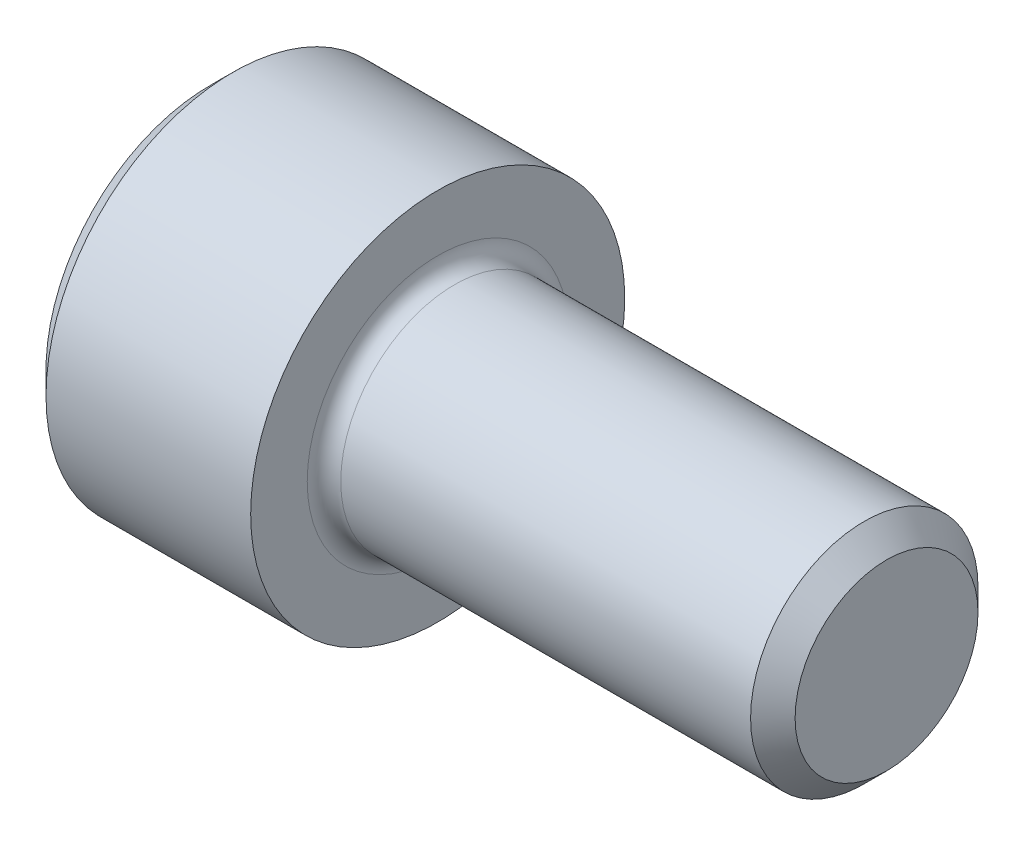
ISO-10303-21;
HEADER;
FILE_DESCRIPTION(('STEP AP214'),'2;1');
FILE_NAME('part.step','',(''),(''),'','','');
FILE_SCHEMA(('AUTOMOTIVE_DESIGN { 1 0 10303 214 1 1 1 1 }'));
ENDSEC;
DATA;
#1=APPLICATION_CONTEXT('core data for automotive mechanical design processes');
#2=APPLICATION_PROTOCOL_DEFINITION('international standard','automotive_design',2000,#1);
#3=PRODUCT_CONTEXT('',#1,'mechanical');
#4=PRODUCT('Part','Part','',(#3));
#5=PRODUCT_RELATED_PRODUCT_CATEGORY('part','',(#4));
#6=PRODUCT_DEFINITION_FORMATION('','',#4);
#7=PRODUCT_DEFINITION_CONTEXT('part definition',#1,'design');
#8=PRODUCT_DEFINITION('design','',#6,#7);
#9=PRODUCT_DEFINITION_SHAPE('','',#8);
#10=(LENGTH_UNIT() NAMED_UNIT(*) SI_UNIT(.MILLI.,.METRE.));
#11=(NAMED_UNIT(*) PLANE_ANGLE_UNIT() SI_UNIT($,.RADIAN.));
#12=(NAMED_UNIT(*) SI_UNIT($,.STERADIAN.) SOLID_ANGLE_UNIT());
#13=UNCERTAINTY_MEASURE_WITH_UNIT(LENGTH_MEASURE(1.E-05),#10,'distance_accuracy_value','');
#14=(GEOMETRIC_REPRESENTATION_CONTEXT(3) GLOBAL_UNCERTAINTY_ASSIGNED_CONTEXT((#13)) GLOBAL_UNIT_ASSIGNED_CONTEXT((#10,
#11,#12)) REPRESENTATION_CONTEXT('',''));
#15=CARTESIAN_POINT('',(0.,0.,0.));
#16=DIRECTION('',(0.,0.,1.));
#17=DIRECTION('',(1.,0.,0.));
#18=AXIS2_PLACEMENT_3D('',#15,#16,#17);
#19=CARTESIAN_POINT('',(2.286,3.4381381735323,-1.98501));
#20=DIRECTION('',(1.,0.,0.));
#21=DIRECTION('',(0.,0.,-1.));
#22=AXIS2_PLACEMENT_3D('',#19,#20,#21);
#23=PLANE('',#22);
#24=DIRECTION('',(0.,1.,0.));
#25=VECTOR('',#24,1.);
#26=CARTESIAN_POINT('',(2.286,3.4381381735323,1.98501));
#27=LINE('',#26,#25);
#28=CARTESIAN_POINT('',(2.28600000003503,0.,1.985009999957));
#29=VERTEX_POINT('',#28);
#30=CARTESIAN_POINT('',(2.286,-1.14604605784409,1.98501));
#31=VERTEX_POINT('',#30);
#32=EDGE_CURVE('E95',#29,#31,#27,.F.);
#33=ORIENTED_EDGE('',*,*,#32,.F.);
#34=CARTESIAN_POINT('',(2.28600000004166,0.,0.));
#35=DIRECTION('',(-1.,0.,0.));
#36=DIRECTION('',(0.,0.,1.));
#37=AXIS2_PLACEMENT_3D('',#34,#35,#36);
#38=CIRCLE('',#37,1.98500999999851);
#39=CARTESIAN_POINT('',(2.28600000002083,-1.7190690867655,0.992504999999628));
#40=VERTEX_POINT('',#39);
#41=EDGE_CURVE('E97',#29,#40,#38,.F.);
#42=ORIENTED_EDGE('',*,*,#41,.T.);
#43=DIRECTION('',(0.,-0.500000000000001,-0.866025403784438));
#44=VECTOR('',#43,1.);
#45=CARTESIAN_POINT('',(2.286,-1.14604605784409,1.98501));
#46=LINE('',#45,#44);
#47=EDGE_CURVE('E100',#31,#40,#46,.T.);
#48=ORIENTED_EDGE('',*,*,#47,.F.);
#49=EDGE_LOOP('',(#33,#42,#48));
#50=FACE_BOUND('',#49,.T.);
#51=ADVANCED_FACE('F16',(#50),#23,.F.);
#52=CARTESIAN_POINT('',(2.286,3.4381381735323,-1.98501));
#53=DIRECTION('',(1.,0.,0.));
#54=DIRECTION('',(0.,0.,-1.));
#55=AXIS2_PLACEMENT_3D('',#52,#53,#54);
#56=PLANE('',#55);
#57=DIRECTION('',(0.,-0.500000000000001,-0.866025403784438));
#58=VECTOR('',#57,1.);
#59=CARTESIAN_POINT('',(2.286,-1.71906908676614,0.992505));
#60=LINE('',#59,#58);
#61=CARTESIAN_POINT('',(2.286,-2.29209211568819,0.));
#62=VERTEX_POINT('',#61);
#63=EDGE_CURVE('E168',#40,#62,#60,.T.);
#64=ORIENTED_EDGE('',*,*,#63,.F.);
#65=CARTESIAN_POINT('',(2.28600000004166,0.,0.));
#66=DIRECTION('',(-1.,0.,0.));
#67=DIRECTION('',(0.,0.,1.));
#68=AXIS2_PLACEMENT_3D('',#65,#66,#67);
#69=CIRCLE('',#68,1.98500999999851);
#70=CARTESIAN_POINT('',(2.28600000002083,-1.7190690867655,-0.992504999999625));
#71=VERTEX_POINT('',#70);
#72=EDGE_CURVE('E115',#40,#71,#69,.F.);
#73=ORIENTED_EDGE('',*,*,#72,.T.);
#74=DIRECTION('',(0.,0.5,-0.866025403784439));
#75=VECTOR('',#74,1.);
#76=CARTESIAN_POINT('',(2.286,-2.29209211568819,0.));
#77=LINE('',#76,#75);
#78=EDGE_CURVE('E164',#62,#71,#77,.T.);
#79=ORIENTED_EDGE('',*,*,#78,.F.);
#80=EDGE_LOOP('',(#64,#73,#79));
#81=FACE_BOUND('',#80,.T.);
#82=ADVANCED_FACE('F340',(#81),#56,.F.);
#83=CARTESIAN_POINT('',(2.286,3.4381381735323,-1.98501));
#84=DIRECTION('',(1.,0.,0.));
#85=DIRECTION('',(0.,0.,-1.));
#86=AXIS2_PLACEMENT_3D('',#83,#84,#85);
#87=PLANE('',#86);
#88=DIRECTION('',(0.,0.499999999999998,-0.86602540378444));
#89=VECTOR('',#88,1.);
#90=CARTESIAN_POINT('',(2.286,-1.71906908676615,-0.992504999999995));
#91=LINE('',#90,#89);
#92=CARTESIAN_POINT('',(2.286,-1.1460460578441,-1.98501));
#93=VERTEX_POINT('',#92);
#94=EDGE_CURVE('E160',#71,#93,#91,.T.);
#95=ORIENTED_EDGE('',*,*,#94,.F.);
#96=CARTESIAN_POINT('',(2.28600000004166,0.,0.));
#97=DIRECTION('',(-1.,0.,0.));
#98=DIRECTION('',(0.,0.,1.));
#99=AXIS2_PLACEMENT_3D('',#96,#97,#98);
#100=CIRCLE('',#99,1.98500999999851);
#101=CARTESIAN_POINT('',(2.28600000003503,0.,-1.985009999957));
#102=VERTEX_POINT('',#101);
#103=EDGE_CURVE('E217',#71,#102,#100,.F.);
#104=ORIENTED_EDGE('',*,*,#103,.T.);
#105=DIRECTION('',(0.,1.,0.));
#106=VECTOR('',#105,1.);
#107=CARTESIAN_POINT('',(2.286,3.4381381735323,-1.98501));
#108=LINE('',#107,#106);
#109=EDGE_CURVE('E156',#93,#102,#108,.T.);
#110=ORIENTED_EDGE('',*,*,#109,.F.);
#111=EDGE_LOOP('',(#95,#104,#110));
#112=FACE_BOUND('',#111,.T.);
#113=ADVANCED_FACE('F337',(#112),#87,.F.);
#114=CARTESIAN_POINT('',(2.286,3.4381381735323,-1.98501));
#115=DIRECTION('',(1.,0.,0.));
#116=DIRECTION('',(0.,0.,-1.));
#117=AXIS2_PLACEMENT_3D('',#114,#115,#116);
#118=PLANE('',#117);
#119=DIRECTION('',(0.,1.,0.));
#120=VECTOR('',#119,1.);
#121=CARTESIAN_POINT('',(2.286,3.4381381735323,-1.98501));
#122=LINE('',#121,#120);
#123=CARTESIAN_POINT('',(2.286,1.1460460578441,-1.98501));
#124=VERTEX_POINT('',#123);
#125=EDGE_CURVE('E152',#102,#124,#122,.T.);
#126=ORIENTED_EDGE('',*,*,#125,.F.);
#127=CARTESIAN_POINT('',(2.28600000004166,0.,0.));
#128=DIRECTION('',(-1.,0.,0.));
#129=DIRECTION('',(0.,0.,1.));
#130=AXIS2_PLACEMENT_3D('',#127,#128,#129);
#131=CIRCLE('',#130,1.98500999999851);
#132=CARTESIAN_POINT('',(2.28600000002083,1.7190690867655,-0.992504999999631));
#133=VERTEX_POINT('',#132);
#134=EDGE_CURVE('E214',#102,#133,#131,.F.);
#135=ORIENTED_EDGE('',*,*,#134,.T.);
#136=DIRECTION('',(0.,0.500000000000002,0.866025403784438));
#137=VECTOR('',#136,1.);
#138=CARTESIAN_POINT('',(2.286,1.1460460578441,-1.98501));
#139=LINE('',#138,#137);
#140=EDGE_CURVE('E148',#124,#133,#139,.T.);
#141=ORIENTED_EDGE('',*,*,#140,.F.);
#142=EDGE_LOOP('',(#126,#135,#141));
#143=FACE_BOUND('',#142,.T.);
#144=ADVANCED_FACE('F333',(#143),#118,.F.);
#145=CARTESIAN_POINT('',(2.286,3.4381381735323,-1.98501));
#146=DIRECTION('',(1.,0.,0.));
#147=DIRECTION('',(0.,0.,-1.));
#148=AXIS2_PLACEMENT_3D('',#145,#146,#147);
#149=PLANE('',#148);
#150=DIRECTION('',(0.,0.500000000000001,0.866025403784438));
#151=VECTOR('',#150,1.);
#152=CARTESIAN_POINT('',(2.286,1.71906908676615,-0.992505000000005));
#153=LINE('',#152,#151);
#154=CARTESIAN_POINT('',(2.286,2.2920921156882,0.));
#155=VERTEX_POINT('',#154);
#156=EDGE_CURVE('E144',#133,#155,#153,.T.);
#157=ORIENTED_EDGE('',*,*,#156,.F.);
#158=CARTESIAN_POINT('',(2.28600000004166,0.,0.));
#159=DIRECTION('',(-1.,0.,0.));
#160=DIRECTION('',(0.,0.,1.));
#161=AXIS2_PLACEMENT_3D('',#158,#159,#160);
#162=CIRCLE('',#161,1.98500999999851);
#163=CARTESIAN_POINT('',(2.28600000002083,1.71906908676551,0.992504999999626));
#164=VERTEX_POINT('',#163);
#165=EDGE_CURVE('E123',#133,#164,#162,.F.);
#166=ORIENTED_EDGE('',*,*,#165,.T.);
#167=DIRECTION('',(0.,-0.499999999999999,0.866025403784439));
#168=VECTOR('',#167,1.);
#169=CARTESIAN_POINT('',(2.286,2.2920921156882,0.));
#170=LINE('',#169,#168);
#171=EDGE_CURVE('E116',#155,#164,#170,.T.);
#172=ORIENTED_EDGE('',*,*,#171,.F.);
#173=EDGE_LOOP('',(#157,#166,#172));
#174=FACE_BOUND('',#173,.T.);
#175=ADVANCED_FACE('F329',(#174),#149,.F.);
#176=CARTESIAN_POINT('',(2.28600000014012,0.,0.));
#177=DIRECTION('',(-1.,0.,0.));
#178=DIRECTION('',(0.,0.,1.));
#179=AXIS2_PLACEMENT_3D('',#176,#177,#178);
#180=CONICAL_SURFACE('',#179,1.98500999982798,1.04719755103067);
#181=CARTESIAN_POINT('',(3.43204605786696,0.,0.));
#182=VERTEX_POINT('',#181);
#183=VERTEX_LOOP('',#182);
#184=FACE_BOUND('',#183,.T.);
#185=ORIENTED_EDGE('',*,*,#41,.F.);
#186=CARTESIAN_POINT('',(2.28600000004166,0.,0.));
#187=DIRECTION('',(-1.,0.,0.));
#188=DIRECTION('',(0.,0.,1.));
#189=AXIS2_PLACEMENT_3D('',#186,#187,#188);
#190=CIRCLE('',#189,1.98500999999851);
#191=EDGE_CURVE('E111',#29,#164,#190,.T.);
#192=ORIENTED_EDGE('',*,*,#191,.T.);
#193=ORIENTED_EDGE('',*,*,#165,.F.);
#194=ORIENTED_EDGE('',*,*,#134,.F.);
#195=ORIENTED_EDGE('',*,*,#103,.F.);
#196=ORIENTED_EDGE('',*,*,#72,.F.);
#197=EDGE_LOOP('',(#185,#192,#193,#194,#195,#196));
#198=FACE_BOUND('',#197,.T.);
#199=ADVANCED_FACE('F109',(#184,#198),#180,.F.);
#200=CARTESIAN_POINT('',(2.286,3.4381381735323,-1.98501));
#201=DIRECTION('',(1.,0.,0.));
#202=DIRECTION('',(0.,0.,-1.));
#203=AXIS2_PLACEMENT_3D('',#200,#201,#202);
#204=PLANE('',#203);
#205=DIRECTION('',(0.,0.499999999999999,-0.866025403784439));
#206=VECTOR('',#205,1.);
#207=CARTESIAN_POINT('',(2.286,2.2920921156882,0.));
#208=LINE('',#207,#206);
#209=CARTESIAN_POINT('',(2.286,1.14604605784411,1.98501));
#210=VERTEX_POINT('',#209);
#211=EDGE_CURVE('E122',#164,#210,#208,.F.);
#212=ORIENTED_EDGE('',*,*,#211,.F.);
#213=ORIENTED_EDGE('',*,*,#191,.F.);
#214=DIRECTION('',(0.,-1.,0.));
#215=VECTOR('',#214,1.);
#216=CARTESIAN_POINT('',(2.286,-1.14604605784409,1.98501));
#217=LINE('',#216,#215);
#218=EDGE_CURVE('E120',#29,#210,#217,.F.);
#219=ORIENTED_EDGE('',*,*,#218,.T.);
#220=EDGE_LOOP('',(#212,#213,#219));
#221=FACE_BOUND('',#220,.T.);
#222=ADVANCED_FACE('F119',(#221),#204,.F.);
#223=CARTESIAN_POINT('',(2.286,2.2920921156882,0.));
#224=DIRECTION('',(0.,-0.866025403784439,-0.499999999999999));
#225=DIRECTION('',(0.,0.499999999999999,-0.866025403784439));
#226=AXIS2_PLACEMENT_3D('',#223,#224,#225);
#227=PLANE('',#226);
#228=ORIENTED_EDGE('',*,*,#211,.T.);
#229=DIRECTION('',(1.,0.,0.));
#230=VECTOR('',#229,1.);
#231=CARTESIAN_POINT('',(2.286,1.14604605784411,1.98501));
#232=LINE('',#231,#230);
#233=CARTESIAN_POINT('',(0.,1.14604605784411,1.98501));
#234=VERTEX_POINT('',#233);
#235=EDGE_CURVE('E128',#210,#234,#232,.F.);
#236=ORIENTED_EDGE('',*,*,#235,.T.);
#237=DIRECTION('',(0.,-0.499999999999999,0.866025403784439));
#238=VECTOR('',#237,1.);
#239=CARTESIAN_POINT('',(0.,2.2920921156882,0.));
#240=LINE('',#239,#238);
#241=CARTESIAN_POINT('',(0.,2.2920921156882,0.));
#242=VERTEX_POINT('',#241);
#243=EDGE_CURVE('E135',#242,#234,#240,.T.);
#244=ORIENTED_EDGE('',*,*,#243,.F.);
#245=DIRECTION('',(1.,0.,0.));
#246=VECTOR('',#245,1.);
#247=CARTESIAN_POINT('',(2.286,2.2920921156882,0.));
#248=LINE('',#247,#246);
#249=EDGE_CURVE('E179',#242,#155,#248,.T.);
#250=ORIENTED_EDGE('',*,*,#249,.T.);
#251=ORIENTED_EDGE('',*,*,#171,.T.);
#252=EDGE_LOOP('',(#228,#236,#244,#250,#251));
#253=FACE_BOUND('',#252,.T.);
#254=ADVANCED_FACE('F321',(#253),#227,.T.);
#255=CARTESIAN_POINT('',(2.286,-1.14604605784409,1.98501));
#256=DIRECTION('',(0.,0.,1.));
#257=DIRECTION('',(0.,-1.,0.));
#258=AXIS2_PLACEMENT_3D('',#255,#256,#257);
#259=PLANE('',#258);
#260=ORIENTED_EDGE('',*,*,#235,.F.);
#261=ORIENTED_EDGE('',*,*,#218,.F.);
#262=ORIENTED_EDGE('',*,*,#32,.T.);
#263=DIRECTION('',(1.,0.,0.));
#264=VECTOR('',#263,1.);
#265=CARTESIAN_POINT('',(2.286,-1.14604605784409,1.98501));
#266=LINE('',#265,#264);
#267=CARTESIAN_POINT('',(0.,-1.14604605784409,1.98501));
#268=VERTEX_POINT('',#267);
#269=EDGE_CURVE('E130',#268,#31,#266,.T.);
#270=ORIENTED_EDGE('',*,*,#269,.F.);
#271=DIRECTION('',(0.,1.,0.));
#272=VECTOR('',#271,1.);
#273=CARTESIAN_POINT('',(0.,0.,1.98501));
#274=LINE('',#273,#272);
#275=EDGE_CURVE('E364',#234,#268,#274,.F.);
#276=ORIENTED_EDGE('',*,*,#275,.F.);
#277=EDGE_LOOP('',(#260,#261,#262,#270,#276));
#278=FACE_BOUND('',#277,.T.);
#279=ADVANCED_FACE('F126',(#278),#259,.F.);
#280=CARTESIAN_POINT('',(2.286,-1.14604605784409,1.98501));
#281=DIRECTION('',(0.,0.866025403784438,-0.500000000000001));
#282=DIRECTION('',(0.,0.500000000000001,0.866025403784438));
#283=AXIS2_PLACEMENT_3D('',#280,#281,#282);
#284=PLANE('',#283);
#285=ORIENTED_EDGE('',*,*,#63,.T.);
#286=DIRECTION('',(1.,0.,0.));
#287=VECTOR('',#286,1.);
#288=CARTESIAN_POINT('',(2.286,-2.29209211568819,0.));
#289=LINE('',#288,#287);
#290=CARTESIAN_POINT('',(0.,-2.29209211568819,0.));
#291=VERTEX_POINT('',#290);
#292=EDGE_CURVE('E190',#291,#62,#289,.T.);
#293=ORIENTED_EDGE('',*,*,#292,.F.);
#294=DIRECTION('',(0.,-0.500000000000001,-0.866025403784438));
#295=VECTOR('',#294,1.);
#296=CARTESIAN_POINT('',(0.,-1.14604605784409,1.98501));
#297=LINE('',#296,#295);
#298=EDGE_CURVE('E360',#268,#291,#297,.T.);
#299=ORIENTED_EDGE('',*,*,#298,.F.);
#300=ORIENTED_EDGE('',*,*,#269,.T.);
#301=ORIENTED_EDGE('',*,*,#47,.T.);
#302=EDGE_LOOP('',(#285,#293,#299,#300,#301));
#303=FACE_BOUND('',#302,.T.);
#304=ADVANCED_FACE('F314',(#303),#284,.T.);
#305=CARTESIAN_POINT('',(2.286,-2.29209211568819,0.));
#306=DIRECTION('',(0.,0.866025403784439,0.499999999999999));
#307=DIRECTION('',(0.,-0.499999999999999,0.866025403784439));
#308=AXIS2_PLACEMENT_3D('',#305,#306,#307);
#309=PLANE('',#308);
#310=ORIENTED_EDGE('',*,*,#94,.T.);
#311=DIRECTION('',(1.,0.,0.));
#312=VECTOR('',#311,1.);
#313=CARTESIAN_POINT('',(2.286,-1.1460460578441,-1.98501));
#314=LINE('',#313,#312);
#315=CARTESIAN_POINT('',(0.,-1.1460460578441,-1.98501));
#316=VERTEX_POINT('',#315);
#317=EDGE_CURVE('E183',#93,#316,#314,.F.);
#318=ORIENTED_EDGE('',*,*,#317,.T.);
#319=DIRECTION('',(0.,0.499999999999999,-0.866025403784439));
#320=VECTOR('',#319,1.);
#321=CARTESIAN_POINT('',(0.,-2.29209211568819,0.));
#322=LINE('',#321,#320);
#323=EDGE_CURVE('E353',#291,#316,#322,.T.);
#324=ORIENTED_EDGE('',*,*,#323,.F.);
#325=ORIENTED_EDGE('',*,*,#292,.T.);
#326=ORIENTED_EDGE('',*,*,#78,.T.);
#327=EDGE_LOOP('',(#310,#318,#324,#325,#326));
#328=FACE_BOUND('',#327,.T.);
#329=ADVANCED_FACE('F310',(#328),#309,.T.);
#330=CARTESIAN_POINT('',(2.286,1.1460460578441,-1.98501));
#331=DIRECTION('',(0.,0.,-1.));
#332=DIRECTION('',(0.,1.,0.));
#333=AXIS2_PLACEMENT_3D('',#330,#331,#332);
#334=PLANE('',#333);
#335=ORIENTED_EDGE('',*,*,#317,.F.);
#336=ORIENTED_EDGE('',*,*,#109,.T.);
#337=ORIENTED_EDGE('',*,*,#125,.T.);
#338=DIRECTION('',(1.,0.,0.));
#339=VECTOR('',#338,1.);
#340=CARTESIAN_POINT('',(2.286,1.1460460578441,-1.98501));
#341=LINE('',#340,#339);
#342=CARTESIAN_POINT('',(0.,1.1460460578441,-1.98501));
#343=VERTEX_POINT('',#342);
#344=EDGE_CURVE('E182',#124,#343,#341,.F.);
#345=ORIENTED_EDGE('',*,*,#344,.T.);
#346=DIRECTION('',(0.,1.,0.));
#347=VECTOR('',#346,1.);
#348=CARTESIAN_POINT('',(0.,0.,-1.98501));
#349=LINE('',#348,#347);
#350=EDGE_CURVE('E359',#316,#343,#349,.T.);
#351=ORIENTED_EDGE('',*,*,#350,.F.);
#352=EDGE_LOOP('',(#335,#336,#337,#345,#351));
#353=FACE_BOUND('',#352,.T.);
#354=ADVANCED_FACE('F306',(#353),#334,.F.);
#355=CARTESIAN_POINT('',(2.286,2.2920921156882,0.));
#356=DIRECTION('',(0.,0.866025403784438,-0.500000000000001));
#357=DIRECTION('',(0.,0.500000000000001,0.866025403784438));
#358=AXIS2_PLACEMENT_3D('',#355,#356,#357);
#359=PLANE('',#358);
#360=ORIENTED_EDGE('',*,*,#344,.F.);
#361=ORIENTED_EDGE('',*,*,#140,.T.);
#362=ORIENTED_EDGE('',*,*,#156,.T.);
#363=ORIENTED_EDGE('',*,*,#249,.F.);
#364=DIRECTION('',(0.,0.500000000000001,0.866025403784438));
#365=VECTOR('',#364,1.);
#366=CARTESIAN_POINT('',(0.,1.1460460578441,-1.98501));
#367=LINE('',#366,#365);
#368=EDGE_CURVE('E210',#343,#242,#367,.T.);
#369=ORIENTED_EDGE('',*,*,#368,.F.);
#370=EDGE_LOOP('',(#360,#361,#362,#363,#369));
#371=FACE_BOUND('',#370,.T.);
#372=ADVANCED_FACE('F302',(#371),#359,.F.);
#373=CARTESIAN_POINT('',(0.,0.,0.));
#374=DIRECTION('',(-1.,0.,0.));
#375=DIRECTION('',(0.,0.,1.));
#376=AXIS2_PLACEMENT_3D('',#373,#374,#375);
#377=PLANE('',#376);
#378=CARTESIAN_POINT('',(0.,0.,0.));
#379=DIRECTION('',(1.,0.,0.));
#380=DIRECTION('',(0.,0.,-1.));
#381=AXIS2_PLACEMENT_3D('',#378,#379,#380);
#382=CIRCLE('',#381,3.48615000001473);
#383=CARTESIAN_POINT('',(0.,0.,-3.48615000001473));
#384=VERTEX_POINT('',#383);
#385=EDGE_CURVE('E208',#384,#384,#382,.T.);
#386=ORIENTED_EDGE('',*,*,#385,.F.);
#387=EDGE_LOOP('',(#386));
#388=FACE_BOUND('',#387,.T.);
#389=ORIENTED_EDGE('',*,*,#350,.T.);
#390=ORIENTED_EDGE('',*,*,#368,.T.);
#391=ORIENTED_EDGE('',*,*,#243,.T.);
#392=ORIENTED_EDGE('',*,*,#275,.T.);
#393=ORIENTED_EDGE('',*,*,#298,.T.);
#394=ORIENTED_EDGE('',*,*,#323,.T.);
#395=EDGE_LOOP('',(#389,#390,#391,#392,#393,#394));
#396=FACE_BOUND('',#395,.T.);
#397=ADVANCED_FACE('F294',(#388,#396),#377,.T.);
#398=CARTESIAN_POINT('',(0.482600000054845,0.,0.));
#399=DIRECTION('',(1.,0.,0.));
#400=DIRECTION('',(0.,0.,-1.));
#401=AXIS2_PLACEMENT_3D('',#398,#399,#400);
#402=CONICAL_SURFACE('',#401,3.96875000001273,0.785398163338555);
#403=ORIENTED_EDGE('',*,*,#385,.T.);
#404=EDGE_LOOP('',(#403));
#405=FACE_BOUND('',#404,.T.);
#406=CARTESIAN_POINT('',(0.4826,0.,0.));
#407=DIRECTION('',(-1.,0.,0.));
#408=DIRECTION('',(0.,0.,1.));
#409=AXIS2_PLACEMENT_3D('',#406,#407,#408);
#410=CIRCLE('',#409,3.96875);
#411=CARTESIAN_POINT('',(0.4826,0.,3.96875));
#412=VERTEX_POINT('',#411);
#413=EDGE_CURVE('E207',#412,#412,#410,.F.);
#414=ORIENTED_EDGE('',*,*,#413,.F.);
#415=EDGE_LOOP('',(#414));
#416=FACE_BOUND('',#415,.T.);
#417=ADVANCED_FACE('F289',(#405,#416),#402,.T.);
#418=CARTESIAN_POINT('',(-31.75,0.,0.));
#419=DIRECTION('',(-1.,0.,0.));
#420=DIRECTION('',(0.,0.,1.));
#421=AXIS2_PLACEMENT_3D('',#418,#419,#420);
#422=CYLINDRICAL_SURFACE('',#421,3.96875);
#423=CARTESIAN_POINT('',(4.826,0.,0.));
#424=DIRECTION('',(-1.,0.,0.));
#425=DIRECTION('',(0.,0.,1.));
#426=AXIS2_PLACEMENT_3D('',#423,#424,#425);
#427=CIRCLE('',#426,3.96875);
#428=CARTESIAN_POINT('',(4.826,0.,3.96875));
#429=VERTEX_POINT('',#428);
#430=EDGE_CURVE('E204',#429,#429,#427,.F.);
#431=ORIENTED_EDGE('',*,*,#430,.F.);
#432=EDGE_LOOP('',(#431));
#433=FACE_BOUND('',#432,.T.);
#434=ORIENTED_EDGE('',*,*,#413,.T.);
#435=EDGE_LOOP('',(#434));
#436=FACE_BOUND('',#435,.T.);
#437=ADVANCED_FACE('F285',(#433,#436),#422,.T.);
#438=CARTESIAN_POINT('',(14.351,1.94056,0.));
#439=DIRECTION('',(1.,0.,0.));
#440=DIRECTION('',(0.,0.,-1.));
#441=AXIS2_PLACEMENT_3D('',#438,#439,#440);
#442=PLANE('',#441);
#443=CARTESIAN_POINT('',(14.3509999999765,0.,0.));
#444=DIRECTION('',(-1.,0.,0.));
#445=DIRECTION('',(0.,0.,1.));
#446=AXIS2_PLACEMENT_3D('',#443,#444,#445);
#447=CIRCLE('',#446,1.94055999992315);
#448=CARTESIAN_POINT('',(14.3509999999765,0.,1.94055999992315));
#449=VERTEX_POINT('',#448);
#450=EDGE_CURVE('E200',#449,#449,#447,.T.);
#451=ORIENTED_EDGE('',*,*,#450,.F.);
#452=EDGE_LOOP('',(#451));
#453=FACE_BOUND('',#452,.T.);
#454=ADVANCED_FACE('F243',(#453),#442,.T.);
#455=CARTESIAN_POINT('',(4.826,3.96875,0.));
#456=DIRECTION('',(1.,0.,0.));
#457=DIRECTION('',(0.,0.,-1.));
#458=AXIS2_PLACEMENT_3D('',#455,#456,#457);
#459=PLANE('',#458);
#460=ORIENTED_EDGE('',*,*,#430,.T.);
#461=EDGE_LOOP('',(#460));
#462=FACE_BOUND('',#461,.T.);
#463=CARTESIAN_POINT('',(4.826,0.,0.));
#464=DIRECTION('',(1.,0.,0.));
#465=DIRECTION('',(0.,0.,1.));
#466=AXIS2_PLACEMENT_3D('',#463,#464,#465);
#467=CIRCLE('',#466,2.76859999999995);
#468=CARTESIAN_POINT('',(4.826,0.,-2.76859999999995));
#469=VERTEX_POINT('',#468);
#470=CARTESIAN_POINT('',(4.826,0.,2.76859999999995));
#471=VERTEX_POINT('',#470);
#472=EDGE_CURVE('E203',#469,#471,#467,.F.);
#473=ORIENTED_EDGE('',*,*,#472,.T.);
#474=CARTESIAN_POINT('',(4.826,0.,0.));
#475=DIRECTION('',(1.,0.,0.));
#476=DIRECTION('',(0.,0.,-1.));
#477=AXIS2_PLACEMENT_3D('',#474,#475,#476);
#478=CIRCLE('',#477,2.76859999999995);
#479=EDGE_CURVE('E35',#471,#469,#478,.F.);
#480=ORIENTED_EDGE('',*,*,#479,.T.);
#481=EDGE_LOOP('',(#473,#480));
#482=FACE_BOUND('',#481,.T.);
#483=ADVANCED_FACE('F224',(#462,#482),#459,.T.);
#484=CARTESIAN_POINT('',(13.8785599999665,0.,0.));
#485=DIRECTION('',(-1.,0.,0.));
#486=DIRECTION('',(0.,0.,1.));
#487=AXIS2_PLACEMENT_3D('',#484,#485,#486);
#488=CONICAL_SURFACE('',#487,2.41299999993316,0.785398163397448);
#489=CARTESIAN_POINT('',(13.8785599999999,0.,0.));
#490=DIRECTION('',(-1.,0.,0.));
#491=DIRECTION('',(0.,0.,1.));
#492=AXIS2_PLACEMENT_3D('',#489,#490,#491);
#493=CIRCLE('',#492,2.41299999999995);
#494=CARTESIAN_POINT('',(13.8785599999999,0.,2.41299999999995));
#495=VERTEX_POINT('',#494);
#496=EDGE_CURVE('E27',#495,#495,#493,.T.);
#497=ORIENTED_EDGE('',*,*,#496,.F.);
#498=EDGE_LOOP('',(#497));
#499=FACE_BOUND('',#498,.T.);
#500=ORIENTED_EDGE('',*,*,#450,.T.);
#501=EDGE_LOOP('',(#500));
#502=FACE_BOUND('',#501,.T.);
#503=ADVANCED_FACE('F242',(#499,#502),#488,.T.);
#504=CARTESIAN_POINT('',(5.1816,0.,0.));
#505=DIRECTION('',(1.,0.,0.));
#506=DIRECTION('',(0.,0.,-1.));
#507=AXIS2_PLACEMENT_3D('',#504,#505,#506);
#508=TOROIDAL_SURFACE('',#507,2.76859999999995,0.3556);
#509=CARTESIAN_POINT('',(5.1816,0.,0.));
#510=DIRECTION('',(-1.,0.,0.));
#511=DIRECTION('',(0.,0.,1.));
#512=AXIS2_PLACEMENT_3D('',#509,#510,#511);
#513=CIRCLE('',#512,2.41299999999995);
#514=CARTESIAN_POINT('',(5.1816,0.,2.41299999999995));
#515=VERTEX_POINT('',#514);
#516=EDGE_CURVE('E11',#515,#515,#513,.F.);
#517=ORIENTED_EDGE('',*,*,#516,.F.);
#518=EDGE_LOOP('',(#517));
#519=FACE_BOUND('',#518,.T.);
#520=ORIENTED_EDGE('',*,*,#472,.F.);
#521=ORIENTED_EDGE('',*,*,#479,.F.);
#522=EDGE_LOOP('',(#520,#521));
#523=FACE_BOUND('',#522,.T.);
#524=ADVANCED_FACE('F221',(#519,#523),#508,.F.);
#525=CARTESIAN_POINT('',(-31.75,0.,0.));
#526=DIRECTION('',(-1.,0.,0.));
#527=DIRECTION('',(0.,0.,1.));
#528=AXIS2_PLACEMENT_3D('',#525,#526,#527);
#529=CYLINDRICAL_SURFACE('',#528,2.41299999999995);
#530=ORIENTED_EDGE('',*,*,#516,.T.);
#531=EDGE_LOOP('',(#530));
#532=FACE_BOUND('',#531,.T.);
#533=ORIENTED_EDGE('',*,*,#496,.T.);
#534=EDGE_LOOP('',(#533));
#535=FACE_BOUND('',#534,.T.);
#536=ADVANCED_FACE('F267',(#532,#535),#529,.T.);
#537=CLOSED_SHELL('',(#51,#82,#113,#144,#175,#199,#222,#254,#279,#304,#329,#354,#372,#397,#417,
#437,#454,#483,#503,#524,#536));
#538=MANIFOLD_SOLID_BREP('B1',#537);
#539=ADVANCED_BREP_SHAPE_REPRESENTATION('',(#18,#538),#14);
#540=SHAPE_DEFINITION_REPRESENTATION(#9,#539);
ENDSEC;
END-ISO-10303-21;
